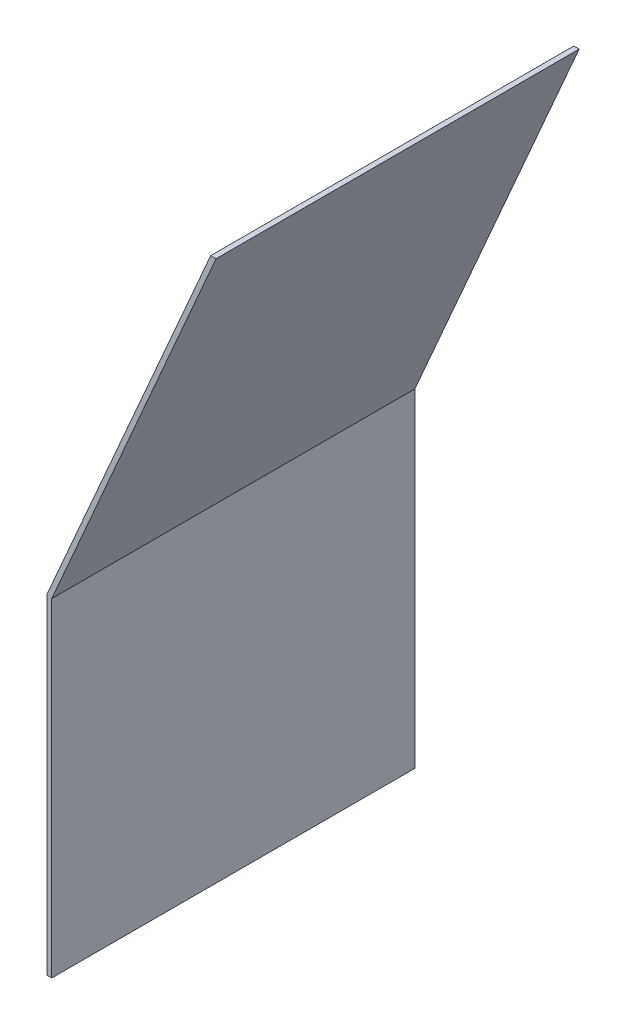
ISO-10303-21;
HEADER;
FILE_DESCRIPTION(('STEP AP214'),'2;1');
FILE_NAME('part.step','',(''),(''),'','','');
FILE_SCHEMA(('AUTOMOTIVE_DESIGN { 1 0 10303 214 1 1 1 1 }'));
ENDSEC;
DATA;
#1=APPLICATION_CONTEXT('core data for automotive mechanical design processes');
#2=APPLICATION_PROTOCOL_DEFINITION('international standard','automotive_design',2000,#1);
#3=PRODUCT_CONTEXT('',#1,'mechanical');
#4=PRODUCT('Part','Part','',(#3));
#5=PRODUCT_RELATED_PRODUCT_CATEGORY('part','',(#4));
#6=PRODUCT_DEFINITION_FORMATION('','',#4);
#7=PRODUCT_DEFINITION_CONTEXT('part definition',#1,'design');
#8=PRODUCT_DEFINITION('design','',#6,#7);
#9=PRODUCT_DEFINITION_SHAPE('','',#8);
#10=(LENGTH_UNIT() NAMED_UNIT(*) SI_UNIT(.MILLI.,.METRE.));
#11=(NAMED_UNIT(*) PLANE_ANGLE_UNIT() SI_UNIT($,.RADIAN.));
#12=(NAMED_UNIT(*) SI_UNIT($,.STERADIAN.) SOLID_ANGLE_UNIT());
#13=UNCERTAINTY_MEASURE_WITH_UNIT(LENGTH_MEASURE(1.E-05),#10,'distance_accuracy_value','');
#14=(GEOMETRIC_REPRESENTATION_CONTEXT(3) GLOBAL_UNCERTAINTY_ASSIGNED_CONTEXT((#13)) GLOBAL_UNIT_ASSIGNED_CONTEXT((#10,
#11,#12)) REPRESENTATION_CONTEXT('',''));
#15=CARTESIAN_POINT('',(0.,0.,0.));
#16=DIRECTION('',(0.,0.,1.));
#17=DIRECTION('',(1.,0.,0.));
#18=AXIS2_PLACEMENT_3D('',#15,#16,#17);
#19=CARTESIAN_POINT('',(0.,101.917042258954,112.268));
#20=DIRECTION('',(1.,0.,0.));
#21=DIRECTION('',(0.,1.,0.));
#22=AXIS2_PLACEMENT_3D('',#19,#20,#21);
#23=PLANE('',#22);
#24=DIRECTION('',(0.,-1.,0.));
#25=VECTOR('',#24,1.);
#26=CARTESIAN_POINT('',(0.,101.917042258954,0.));
#27=LINE('',#26,#25);
#28=CARTESIAN_POINT('',(0.,101.917042258954,0.));
#29=VERTEX_POINT('',#28);
#30=CARTESIAN_POINT('',(0.,0.,0.));
#31=VERTEX_POINT('',#30);
#32=EDGE_CURVE('E128',#29,#31,#27,.T.);
#33=ORIENTED_EDGE('',*,*,#32,.T.);
#34=DIRECTION('',(0.,0.,-1.));
#35=VECTOR('',#34,1.);
#36=CARTESIAN_POINT('',(0.,0.,112.268));
#37=LINE('',#36,#35);
#38=CARTESIAN_POINT('',(0.,0.,112.268));
#39=VERTEX_POINT('',#38);
#40=EDGE_CURVE('E11',#39,#31,#37,.T.);
#41=ORIENTED_EDGE('',*,*,#40,.F.);
#42=DIRECTION('',(0.,-1.,0.));
#43=VECTOR('',#42,1.);
#44=CARTESIAN_POINT('',(0.,101.917042258954,112.268));
#45=LINE('',#44,#43);
#46=CARTESIAN_POINT('',(0.,101.917042258954,112.268));
#47=VERTEX_POINT('',#46);
#48=EDGE_CURVE('E144',#47,#39,#45,.T.);
#49=ORIENTED_EDGE('',*,*,#48,.F.);
#50=DIRECTION('',(0.,0.,-1.));
#51=VECTOR('',#50,1.);
#52=CARTESIAN_POINT('',(0.,101.917042258954,112.268));
#53=LINE('',#52,#51);
#54=EDGE_CURVE('E124',#47,#29,#53,.T.);
#55=ORIENTED_EDGE('',*,*,#54,.T.);
#56=EDGE_LOOP('',(#33,#41,#49,#55));
#57=FACE_BOUND('',#56,.T.);
#58=ADVANCED_FACE('F39',(#57),#23,.F.);
#59=CARTESIAN_POINT('',(0.,0.,112.268));
#60=DIRECTION('',(0.,1.,0.));
#61=DIRECTION('',(0.,0.,1.));
#62=AXIS2_PLACEMENT_3D('',#59,#60,#61);
#63=PLANE('',#62);
#64=DIRECTION('',(1.,0.,0.));
#65=VECTOR('',#64,1.);
#66=CARTESIAN_POINT('',(0.,0.,0.));
#67=LINE('',#66,#65);
#68=CARTESIAN_POINT('',(1.51892,0.,0.));
#69=VERTEX_POINT('',#68);
#70=EDGE_CURVE('E132',#31,#69,#67,.T.);
#71=ORIENTED_EDGE('',*,*,#70,.T.);
#72=DIRECTION('',(0.,0.,-1.));
#73=VECTOR('',#72,1.);
#74=CARTESIAN_POINT('',(1.51892,0.,112.268));
#75=LINE('',#74,#73);
#76=CARTESIAN_POINT('',(1.51892,0.,112.268));
#77=VERTEX_POINT('',#76);
#78=EDGE_CURVE('E48',#77,#69,#75,.T.);
#79=ORIENTED_EDGE('',*,*,#78,.F.);
#80=DIRECTION('',(1.,0.,0.));
#81=VECTOR('',#80,1.);
#82=CARTESIAN_POINT('',(0.,0.,112.268));
#83=LINE('',#82,#81);
#84=EDGE_CURVE('E93',#39,#77,#83,.T.);
#85=ORIENTED_EDGE('',*,*,#84,.F.);
#86=ORIENTED_EDGE('',*,*,#40,.T.);
#87=EDGE_LOOP('',(#71,#79,#85,#86));
#88=FACE_BOUND('',#87,.T.);
#89=ADVANCED_FACE('F172',(#88),#63,.F.);
#90=CARTESIAN_POINT('',(1.51892,0.,112.268));
#91=DIRECTION('',(-1.,0.,0.));
#92=DIRECTION('',(0.,0.,1.));
#93=AXIS2_PLACEMENT_3D('',#90,#91,#92);
#94=PLANE('',#93);
#95=DIRECTION('',(0.,1.,0.));
#96=VECTOR('',#95,1.);
#97=CARTESIAN_POINT('',(1.51892,0.,0.));
#98=LINE('',#97,#96);
#99=CARTESIAN_POINT('',(1.51892,101.6,0.));
#100=VERTEX_POINT('',#99);
#101=EDGE_CURVE('E135',#69,#100,#98,.T.);
#102=ORIENTED_EDGE('',*,*,#101,.T.);
#103=DIRECTION('',(0.,0.,-1.));
#104=VECTOR('',#103,1.);
#105=CARTESIAN_POINT('',(1.51892,101.6,112.268));
#106=LINE('',#105,#104);
#107=CARTESIAN_POINT('',(1.51892,101.6,112.268));
#108=VERTEX_POINT('',#107);
#109=EDGE_CURVE('E117',#108,#100,#106,.T.);
#110=ORIENTED_EDGE('',*,*,#109,.F.);
#111=DIRECTION('',(0.,1.,0.));
#112=VECTOR('',#111,1.);
#113=CARTESIAN_POINT('',(1.51892,0.,112.268));
#114=LINE('',#113,#112);
#115=EDGE_CURVE('E106',#77,#108,#114,.T.);
#116=ORIENTED_EDGE('',*,*,#115,.F.);
#117=ORIENTED_EDGE('',*,*,#78,.T.);
#118=EDGE_LOOP('',(#102,#110,#116,#117));
#119=FACE_BOUND('',#118,.T.);
#120=ADVANCED_FACE('F154',(#119),#94,.F.);
#121=CARTESIAN_POINT('',(1.51892,101.6,112.268));
#122=DIRECTION('',(-0.916502421906898,0.400029137237266,0.));
#123=DIRECTION('',(-0.400029137237266,-0.916502421906898,0.));
#124=AXIS2_PLACEMENT_3D('',#121,#122,#123);
#125=PLANE('',#124);
#126=DIRECTION('',(0.400029137237266,0.916502421906898,0.));
#127=VECTOR('',#126,1.);
#128=CARTESIAN_POINT('',(1.51892,101.6,0.));
#129=LINE('',#128,#127);
#130=CARTESIAN_POINT('',(52.3226204291327,217.995807582176,0.));
#131=VERTEX_POINT('',#130);
#132=EDGE_CURVE('E115',#100,#131,#129,.T.);
#133=ORIENTED_EDGE('',*,*,#132,.T.);
#134=DIRECTION('',(0.,0.,-1.));
#135=VECTOR('',#134,1.);
#136=CARTESIAN_POINT('',(52.3226204291327,217.995807582176,112.268));
#137=LINE('',#136,#135);
#138=CARTESIAN_POINT('',(52.3226204291327,217.995807582176,112.268));
#139=VERTEX_POINT('',#138);
#140=EDGE_CURVE('E112',#139,#131,#137,.T.);
#141=ORIENTED_EDGE('',*,*,#140,.F.);
#142=DIRECTION('',(0.400029137237266,0.916502421906898,0.));
#143=VECTOR('',#142,1.);
#144=CARTESIAN_POINT('',(1.51892,101.6,112.268));
#145=LINE('',#144,#143);
#146=EDGE_CURVE('E100',#108,#139,#145,.T.);
#147=ORIENTED_EDGE('',*,*,#146,.F.);
#148=ORIENTED_EDGE('',*,*,#109,.T.);
#149=EDGE_LOOP('',(#133,#141,#147,#148));
#150=FACE_BOUND('',#149,.T.);
#151=ADVANCED_FACE('F113',(#150),#125,.F.);
#152=CARTESIAN_POINT('',(52.3226204291327,217.995807582176,112.268));
#153=DIRECTION('',(0.,-1.,0.));
#154=DIRECTION('',(0.,0.,-1.));
#155=AXIS2_PLACEMENT_3D('',#152,#153,#154);
#156=PLANE('',#155);
#157=DIRECTION('',(-1.,0.,0.));
#158=VECTOR('',#157,1.);
#159=CARTESIAN_POINT('',(52.3226204291327,217.995807582176,0.));
#160=LINE('',#159,#158);
#161=CARTESIAN_POINT('',(50.6653198441112,217.995807582176,0.));
#162=VERTEX_POINT('',#161);
#163=EDGE_CURVE('E79',#131,#162,#160,.T.);
#164=ORIENTED_EDGE('',*,*,#163,.T.);
#165=DIRECTION('',(0.,0.,-1.));
#166=VECTOR('',#165,1.);
#167=CARTESIAN_POINT('',(50.6653198441112,217.995807582176,112.268));
#168=LINE('',#167,#166);
#169=CARTESIAN_POINT('',(50.6653198441112,217.995807582176,112.268));
#170=VERTEX_POINT('',#169);
#171=EDGE_CURVE('E118',#170,#162,#168,.T.);
#172=ORIENTED_EDGE('',*,*,#171,.F.);
#173=DIRECTION('',(-1.,0.,0.));
#174=VECTOR('',#173,1.);
#175=CARTESIAN_POINT('',(52.3226204291327,217.995807582176,112.268));
#176=LINE('',#175,#174);
#177=EDGE_CURVE('E104',#139,#170,#176,.T.);
#178=ORIENTED_EDGE('',*,*,#177,.F.);
#179=ORIENTED_EDGE('',*,*,#140,.T.);
#180=EDGE_LOOP('',(#164,#172,#178,#179));
#181=FACE_BOUND('',#180,.T.);
#182=ADVANCED_FACE('F120',(#181),#156,.F.);
#183=CARTESIAN_POINT('',(50.6653198441112,217.995807582176,112.268));
#184=DIRECTION('',(0.916502421906898,-0.400029137237266,0.));
#185=DIRECTION('',(0.400029137237266,0.916502421906898,0.));
#186=AXIS2_PLACEMENT_3D('',#183,#184,#185);
#187=PLANE('',#186);
#188=DIRECTION('',(-0.400029137237266,-0.916502421906898,0.));
#189=VECTOR('',#188,1.);
#190=CARTESIAN_POINT('',(50.6653198441112,217.995807582176,0.));
#191=LINE('',#190,#189);
#192=EDGE_CURVE('E85',#162,#29,#191,.T.);
#193=ORIENTED_EDGE('',*,*,#192,.T.);
#194=ORIENTED_EDGE('',*,*,#54,.F.);
#195=DIRECTION('',(-0.400029137237266,-0.916502421906898,0.));
#196=VECTOR('',#195,1.);
#197=CARTESIAN_POINT('',(50.6653198441112,217.995807582176,112.268));
#198=LINE('',#197,#196);
#199=EDGE_CURVE('E56',#170,#47,#198,.T.);
#200=ORIENTED_EDGE('',*,*,#199,.F.);
#201=ORIENTED_EDGE('',*,*,#171,.T.);
#202=EDGE_LOOP('',(#193,#194,#200,#201));
#203=FACE_BOUND('',#202,.T.);
#204=ADVANCED_FACE('F161',(#203),#187,.F.);
#205=CARTESIAN_POINT('',(0.,0.,112.268));
#206=DIRECTION('',(0.,0.,1.));
#207=DIRECTION('',(1.,0.,0.));
#208=AXIS2_PLACEMENT_3D('',#205,#206,#207);
#209=PLANE('',#208);
#210=ORIENTED_EDGE('',*,*,#48,.T.);
#211=ORIENTED_EDGE('',*,*,#84,.T.);
#212=ORIENTED_EDGE('',*,*,#115,.T.);
#213=ORIENTED_EDGE('',*,*,#146,.T.);
#214=ORIENTED_EDGE('',*,*,#177,.T.);
#215=ORIENTED_EDGE('',*,*,#199,.T.);
#216=EDGE_LOOP('',(#210,#211,#212,#213,#214,#215));
#217=FACE_BOUND('',#216,.T.);
#218=ADVANCED_FACE('F102',(#217),#209,.T.);
#219=CARTESIAN_POINT('',(0.,0.,0.));
#220=DIRECTION('',(0.,0.,1.));
#221=DIRECTION('',(1.,0.,0.));
#222=AXIS2_PLACEMENT_3D('',#219,#220,#221);
#223=PLANE('',#222);
#224=ORIENTED_EDGE('',*,*,#32,.F.);
#225=ORIENTED_EDGE('',*,*,#192,.F.);
#226=ORIENTED_EDGE('',*,*,#163,.F.);
#227=ORIENTED_EDGE('',*,*,#132,.F.);
#228=ORIENTED_EDGE('',*,*,#101,.F.);
#229=ORIENTED_EDGE('',*,*,#70,.F.);
#230=EDGE_LOOP('',(#224,#225,#226,#227,#228,#229));
#231=FACE_BOUND('',#230,.T.);
#232=ADVANCED_FACE('F157',(#231),#223,.F.);
#233=CLOSED_SHELL('',(#58,#89,#120,#151,#182,#204,#218,#232));
#234=MANIFOLD_SOLID_BREP('B2',#233);
#235=ADVANCED_BREP_SHAPE_REPRESENTATION('',(#18,#234),#14);
#236=SHAPE_DEFINITION_REPRESENTATION(#9,#235);
ENDSEC;
END-ISO-10303-21;
